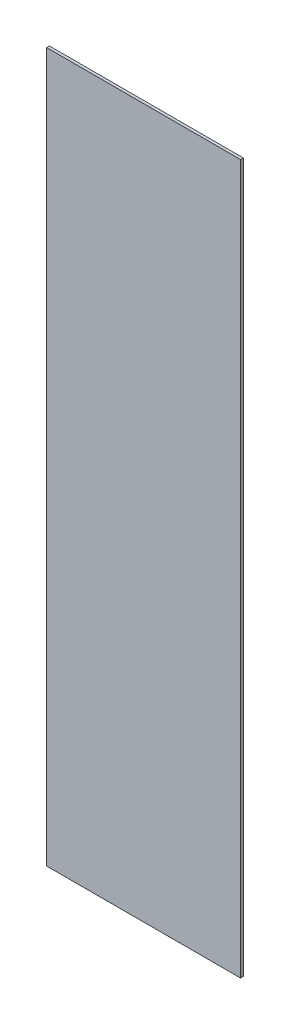
ISO-10303-21;
HEADER;
FILE_DESCRIPTION(('STEP AP214'),'2;1');
FILE_NAME('part.step','',(''),(''),'','','');
FILE_SCHEMA(('AUTOMOTIVE_DESIGN { 1 0 10303 214 1 1 1 1 }'));
ENDSEC;
DATA;
#1=APPLICATION_CONTEXT('core data for automotive mechanical design processes');
#2=APPLICATION_PROTOCOL_DEFINITION('international standard','automotive_design',2000,#1);
#3=PRODUCT_CONTEXT('',#1,'mechanical');
#4=PRODUCT('Part','Part','',(#3));
#5=PRODUCT_RELATED_PRODUCT_CATEGORY('part','',(#4));
#6=PRODUCT_DEFINITION_FORMATION('','',#4);
#7=PRODUCT_DEFINITION_CONTEXT('part definition',#1,'design');
#8=PRODUCT_DEFINITION('design','',#6,#7);
#9=PRODUCT_DEFINITION_SHAPE('','',#8);
#10=(LENGTH_UNIT() NAMED_UNIT(*) SI_UNIT(.MILLI.,.METRE.));
#11=(NAMED_UNIT(*) PLANE_ANGLE_UNIT() SI_UNIT($,.RADIAN.));
#12=(NAMED_UNIT(*) SI_UNIT($,.STERADIAN.) SOLID_ANGLE_UNIT());
#13=UNCERTAINTY_MEASURE_WITH_UNIT(LENGTH_MEASURE(1.E-05),#10,'distance_accuracy_value','');
#14=(GEOMETRIC_REPRESENTATION_CONTEXT(3) GLOBAL_UNCERTAINTY_ASSIGNED_CONTEXT((#13)) GLOBAL_UNIT_ASSIGNED_CONTEXT((#10,
#11,#12)) REPRESENTATION_CONTEXT('',''));
#15=CARTESIAN_POINT('',(0.,0.,0.));
#16=DIRECTION('',(0.,0.,1.));
#17=DIRECTION('',(1.,0.,0.));
#18=AXIS2_PLACEMENT_3D('',#15,#16,#17);
#19=CARTESIAN_POINT('',(-96.3283680276019,227.584,2.54));
#20=DIRECTION('',(1.,0.,0.));
#21=DIRECTION('',(0.,1.,0.));
#22=AXIS2_PLACEMENT_3D('',#19,#20,#21);
#23=PLANE('',#22);
#24=DIRECTION('',(0.,-1.,0.));
#25=VECTOR('',#24,1.);
#26=CARTESIAN_POINT('',(-96.3283680276019,227.584,0.));
#27=LINE('',#26,#25);
#28=CARTESIAN_POINT('',(-96.3283680276019,227.584,0.));
#29=VERTEX_POINT('',#28);
#30=CARTESIAN_POINT('',(-96.3283680276018,-422.656,0.));
#31=VERTEX_POINT('',#30);
#32=EDGE_CURVE('E95',#29,#31,#27,.T.);
#33=ORIENTED_EDGE('',*,*,#32,.T.);
#34=DIRECTION('',(0.,0.,-1.));
#35=VECTOR('',#34,1.);
#36=CARTESIAN_POINT('',(-96.3283680276018,-422.656,2.54));
#37=LINE('',#36,#35);
#38=CARTESIAN_POINT('',(-96.3283680276018,-422.656,2.54));
#39=VERTEX_POINT('',#38);
#40=EDGE_CURVE('E11',#39,#31,#37,.T.);
#41=ORIENTED_EDGE('',*,*,#40,.F.);
#42=DIRECTION('',(0.,-1.,0.));
#43=VECTOR('',#42,1.);
#44=CARTESIAN_POINT('',(-96.3283680276019,227.584,2.54));
#45=LINE('',#44,#43);
#46=CARTESIAN_POINT('',(-96.3283680276019,227.584,2.54));
#47=VERTEX_POINT('',#46);
#48=EDGE_CURVE('E83',#47,#39,#45,.T.);
#49=ORIENTED_EDGE('',*,*,#48,.F.);
#50=DIRECTION('',(0.,0.,-1.));
#51=VECTOR('',#50,1.);
#52=CARTESIAN_POINT('',(-96.3283680276019,227.584,2.54));
#53=LINE('',#52,#51);
#54=EDGE_CURVE('E91',#47,#29,#53,.T.);
#55=ORIENTED_EDGE('',*,*,#54,.T.);
#56=EDGE_LOOP('',(#33,#41,#49,#55));
#57=FACE_BOUND('',#56,.T.);
#58=ADVANCED_FACE('F32',(#57),#23,.F.);
#59=CARTESIAN_POINT('',(-96.3283680276018,-422.656,2.54));
#60=DIRECTION('',(0.,1.,0.));
#61=DIRECTION('',(0.,0.,1.));
#62=AXIS2_PLACEMENT_3D('',#59,#60,#61);
#63=PLANE('',#62);
#64=DIRECTION('',(1.,0.,0.));
#65=VECTOR('',#64,1.);
#66=CARTESIAN_POINT('',(-96.3283680276018,-422.656,0.));
#67=LINE('',#66,#65);
#68=CARTESIAN_POINT('',(81.4716319723981,-422.656,0.));
#69=VERTEX_POINT('',#68);
#70=EDGE_CURVE('E87',#31,#69,#67,.T.);
#71=ORIENTED_EDGE('',*,*,#70,.T.);
#72=DIRECTION('',(0.,0.,-1.));
#73=VECTOR('',#72,1.);
#74=CARTESIAN_POINT('',(81.4716319723981,-422.656,2.54));
#75=LINE('',#74,#73);
#76=CARTESIAN_POINT('',(81.4716319723981,-422.656,2.54));
#77=VERTEX_POINT('',#76);
#78=EDGE_CURVE('E40',#77,#69,#75,.T.);
#79=ORIENTED_EDGE('',*,*,#78,.F.);
#80=DIRECTION('',(1.,0.,0.));
#81=VECTOR('',#80,1.);
#82=CARTESIAN_POINT('',(-96.3283680276018,-422.656,2.54));
#83=LINE('',#82,#81);
#84=EDGE_CURVE('E78',#39,#77,#83,.T.);
#85=ORIENTED_EDGE('',*,*,#84,.F.);
#86=ORIENTED_EDGE('',*,*,#40,.T.);
#87=EDGE_LOOP('',(#71,#79,#85,#86));
#88=FACE_BOUND('',#87,.T.);
#89=ADVANCED_FACE('F86',(#88),#63,.F.);
#90=CARTESIAN_POINT('',(81.4716319723981,227.584,2.54));
#91=DIRECTION('',(-1.,0.,0.));
#92=DIRECTION('',(0.,0.,1.));
#93=AXIS2_PLACEMENT_3D('',#90,#91,#92);
#94=PLANE('',#93);
#95=DIRECTION('',(0.,1.,0.));
#96=VECTOR('',#95,1.);
#97=CARTESIAN_POINT('',(81.4716319723981,227.584,0.));
#98=LINE('',#97,#96);
#99=CARTESIAN_POINT('',(81.4716319723981,227.584,0.));
#100=VERTEX_POINT('',#99);
#101=EDGE_CURVE('E65',#69,#100,#98,.T.);
#102=ORIENTED_EDGE('',*,*,#101,.T.);
#103=DIRECTION('',(0.,0.,-1.));
#104=VECTOR('',#103,1.);
#105=CARTESIAN_POINT('',(81.4716319723981,227.584,2.54));
#106=LINE('',#105,#104);
#107=CARTESIAN_POINT('',(81.4716319723981,227.584,2.54));
#108=VERTEX_POINT('',#107);
#109=EDGE_CURVE('E88',#108,#100,#106,.T.);
#110=ORIENTED_EDGE('',*,*,#109,.F.);
#111=DIRECTION('',(0.,1.,0.));
#112=VECTOR('',#111,1.);
#113=CARTESIAN_POINT('',(81.4716319723981,227.584,2.54));
#114=LINE('',#113,#112);
#115=EDGE_CURVE('E81',#77,#108,#114,.T.);
#116=ORIENTED_EDGE('',*,*,#115,.F.);
#117=ORIENTED_EDGE('',*,*,#78,.T.);
#118=EDGE_LOOP('',(#102,#110,#116,#117));
#119=FACE_BOUND('',#118,.T.);
#120=ADVANCED_FACE('F89',(#119),#94,.F.);
#121=CARTESIAN_POINT('',(-96.3283680276019,227.584,2.54));
#122=DIRECTION('',(0.,-1.,0.));
#123=DIRECTION('',(0.,0.,-1.));
#124=AXIS2_PLACEMENT_3D('',#121,#122,#123);
#125=PLANE('',#124);
#126=DIRECTION('',(-1.,0.,0.));
#127=VECTOR('',#126,1.);
#128=CARTESIAN_POINT('',(-96.3283680276019,227.584,0.));
#129=LINE('',#128,#127);
#130=EDGE_CURVE('E71',#100,#29,#129,.T.);
#131=ORIENTED_EDGE('',*,*,#130,.T.);
#132=ORIENTED_EDGE('',*,*,#54,.F.);
#133=DIRECTION('',(-1.,0.,0.));
#134=VECTOR('',#133,1.);
#135=CARTESIAN_POINT('',(-96.3283680276019,227.584,2.54));
#136=LINE('',#135,#134);
#137=EDGE_CURVE('E48',#108,#47,#136,.T.);
#138=ORIENTED_EDGE('',*,*,#137,.F.);
#139=ORIENTED_EDGE('',*,*,#109,.T.);
#140=EDGE_LOOP('',(#131,#132,#138,#139));
#141=FACE_BOUND('',#140,.T.);
#142=ADVANCED_FACE('F102',(#141),#125,.F.);
#143=CARTESIAN_POINT('',(0.,0.,2.54));
#144=DIRECTION('',(0.,0.,1.));
#145=DIRECTION('',(1.,0.,0.));
#146=AXIS2_PLACEMENT_3D('',#143,#144,#145);
#147=PLANE('',#146);
#148=ORIENTED_EDGE('',*,*,#48,.T.);
#149=ORIENTED_EDGE('',*,*,#84,.T.);
#150=ORIENTED_EDGE('',*,*,#115,.T.);
#151=ORIENTED_EDGE('',*,*,#137,.T.);
#152=EDGE_LOOP('',(#148,#149,#150,#151));
#153=FACE_BOUND('',#152,.T.);
#154=ADVANCED_FACE('F79',(#153),#147,.T.);
#155=CARTESIAN_POINT('',(0.,0.,0.));
#156=DIRECTION('',(0.,0.,1.));
#157=DIRECTION('',(1.,0.,0.));
#158=AXIS2_PLACEMENT_3D('',#155,#156,#157);
#159=PLANE('',#158);
#160=ORIENTED_EDGE('',*,*,#32,.F.);
#161=ORIENTED_EDGE('',*,*,#130,.F.);
#162=ORIENTED_EDGE('',*,*,#101,.F.);
#163=ORIENTED_EDGE('',*,*,#70,.F.);
#164=EDGE_LOOP('',(#160,#161,#162,#163));
#165=FACE_BOUND('',#164,.T.);
#166=ADVANCED_FACE('F105',(#165),#159,.F.);
#167=CLOSED_SHELL('',(#58,#89,#120,#142,#154,#166));
#168=MANIFOLD_SOLID_BREP('B2',#167);
#169=ADVANCED_BREP_SHAPE_REPRESENTATION('',(#18,#168),#14);
#170=SHAPE_DEFINITION_REPRESENTATION(#9,#169);
ENDSEC;
END-ISO-10303-21;
